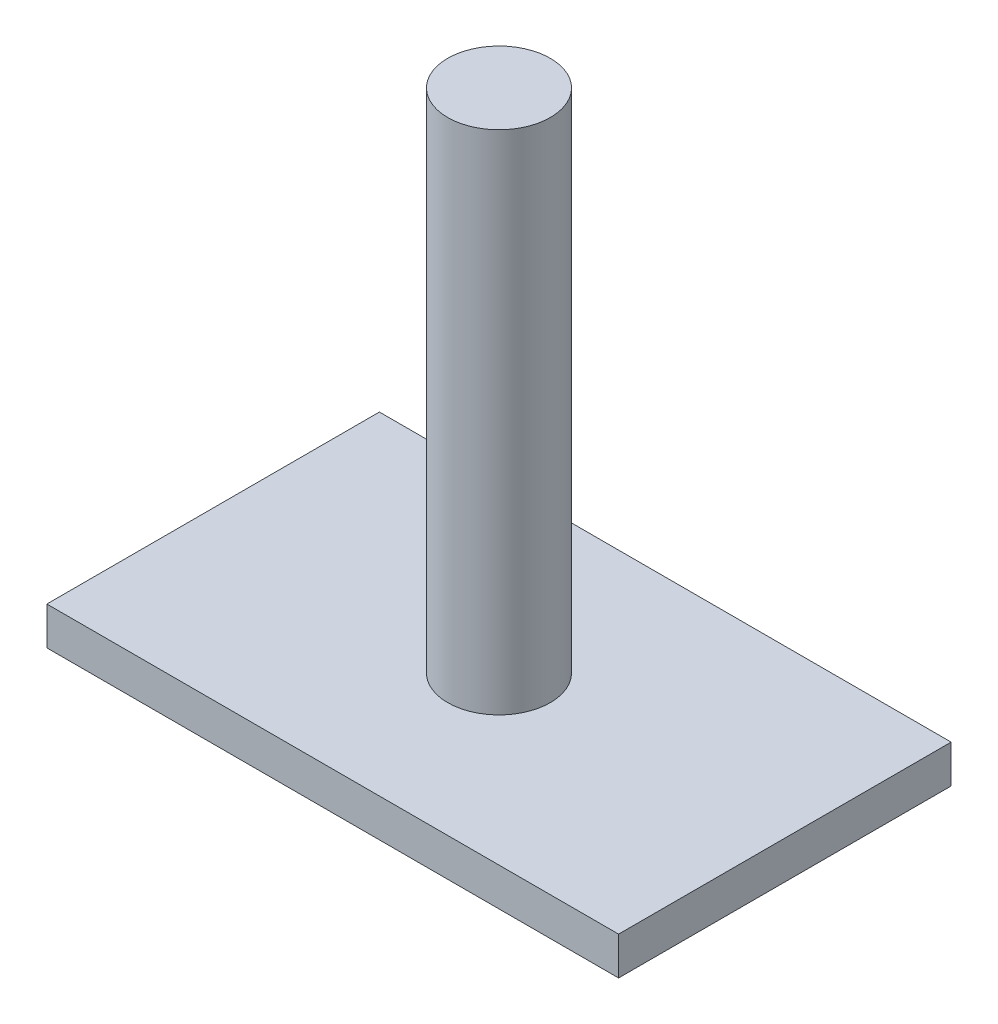
ISO-10303-21;
HEADER;
FILE_DESCRIPTION(('STEP AP214'),'2;1');
FILE_NAME('part.step','',(''),(''),'','','');
FILE_SCHEMA(('AUTOMOTIVE_DESIGN { 1 0 10303 214 1 1 1 1 }'));
ENDSEC;
DATA;
#1=APPLICATION_CONTEXT('core data for automotive mechanical design processes');
#2=APPLICATION_PROTOCOL_DEFINITION('international standard','automotive_design',2000,#1);
#3=PRODUCT_CONTEXT('',#1,'mechanical');
#4=PRODUCT('Part','Part','',(#3));
#5=PRODUCT_RELATED_PRODUCT_CATEGORY('part','',(#4));
#6=PRODUCT_DEFINITION_FORMATION('','',#4);
#7=PRODUCT_DEFINITION_CONTEXT('part definition',#1,'design');
#8=PRODUCT_DEFINITION('design','',#6,#7);
#9=PRODUCT_DEFINITION_SHAPE('','',#8);
#10=(LENGTH_UNIT() NAMED_UNIT(*) SI_UNIT(.MILLI.,.METRE.));
#11=(NAMED_UNIT(*) PLANE_ANGLE_UNIT() SI_UNIT($,.RADIAN.));
#12=(NAMED_UNIT(*) SI_UNIT($,.STERADIAN.) SOLID_ANGLE_UNIT());
#13=UNCERTAINTY_MEASURE_WITH_UNIT(LENGTH_MEASURE(1.E-05),#10,'distance_accuracy_value','');
#14=(GEOMETRIC_REPRESENTATION_CONTEXT(3) GLOBAL_UNCERTAINTY_ASSIGNED_CONTEXT((#13)) GLOBAL_UNIT_ASSIGNED_CONTEXT((#10,
#11,#12)) REPRESENTATION_CONTEXT('',''));
#15=CARTESIAN_POINT('',(0.,0.,0.));
#16=DIRECTION('',(0.,0.,1.));
#17=DIRECTION('',(1.,0.,0.));
#18=AXIS2_PLACEMENT_3D('',#15,#16,#17);
#19=CARTESIAN_POINT('',(0.,40.,0.));
#20=DIRECTION('',(0.,-1.,0.));
#21=DIRECTION('',(0.,0.,-1.));
#22=AXIS2_PLACEMENT_3D('',#19,#20,#21);
#23=CYLINDRICAL_SURFACE('',#22,4.05);
#24=CARTESIAN_POINT('',(0.,40.,0.));
#25=DIRECTION('',(0.,1.,0.));
#26=DIRECTION('',(0.,0.,1.));
#27=AXIS2_PLACEMENT_3D('',#24,#25,#26);
#28=CIRCLE('',#27,4.05);
#29=CARTESIAN_POINT('',(0.,40.,4.05));
#30=VERTEX_POINT('',#29);
#31=EDGE_CURVE('E11',#30,#30,#28,.T.);
#32=ORIENTED_EDGE('',*,*,#31,.F.);
#33=EDGE_LOOP('',(#32));
#34=FACE_BOUND('',#33,.T.);
#35=CARTESIAN_POINT('',(0.,0.,0.));
#36=DIRECTION('',(0.,1.,0.));
#37=DIRECTION('',(0.,0.,1.));
#38=AXIS2_PLACEMENT_3D('',#35,#36,#37);
#39=CIRCLE('',#38,4.05);
#40=CARTESIAN_POINT('',(0.,0.,4.05));
#41=VERTEX_POINT('',#40);
#42=EDGE_CURVE('E36',#41,#41,#39,.T.);
#43=ORIENTED_EDGE('',*,*,#42,.T.);
#44=EDGE_LOOP('',(#43));
#45=FACE_BOUND('',#44,.T.);
#46=ADVANCED_FACE('F33',(#34,#45),#23,.T.);
#47=CARTESIAN_POINT('',(0.,40.,0.));
#48=DIRECTION('',(0.,1.,0.));
#49=DIRECTION('',(0.,0.,1.));
#50=AXIS2_PLACEMENT_3D('',#47,#48,#49);
#51=PLANE('',#50);
#52=ORIENTED_EDGE('',*,*,#31,.T.);
#53=EDGE_LOOP('',(#52));
#54=FACE_BOUND('',#53,.T.);
#55=ADVANCED_FACE('F129',(#54),#51,.T.);
#56=CARTESIAN_POINT('',(22.5639988281978,-3.,13.1244227055141));
#57=DIRECTION('',(-1.,0.,0.));
#58=DIRECTION('',(0.,0.,1.));
#59=AXIS2_PLACEMENT_3D('',#56,#57,#58);
#60=PLANE('',#59);
#61=DIRECTION('',(0.,0.,1.));
#62=VECTOR('',#61,1.);
#63=CARTESIAN_POINT('',(22.5639988281978,0.,13.1244227055141));
#64=LINE('',#63,#62);
#65=CARTESIAN_POINT('',(22.5639988281978,0.,-13.1244227055141));
#66=VERTEX_POINT('',#65);
#67=CARTESIAN_POINT('',(22.5639988281978,0.,13.1244227055141));
#68=VERTEX_POINT('',#67);
#69=EDGE_CURVE('E100',#66,#68,#64,.T.);
#70=ORIENTED_EDGE('',*,*,#69,.T.);
#71=DIRECTION('',(0.,1.,0.));
#72=VECTOR('',#71,1.);
#73=CARTESIAN_POINT('',(22.5639988281978,-3.,13.1244227055141));
#74=LINE('',#73,#72);
#75=CARTESIAN_POINT('',(22.5639988281978,-3.,13.1244227055141));
#76=VERTEX_POINT('',#75);
#77=EDGE_CURVE('E91',#76,#68,#74,.T.);
#78=ORIENTED_EDGE('',*,*,#77,.F.);
#79=DIRECTION('',(0.,0.,1.));
#80=VECTOR('',#79,1.);
#81=CARTESIAN_POINT('',(22.5639988281978,-3.,13.1244227055141));
#82=LINE('',#81,#80);
#83=CARTESIAN_POINT('',(22.5639988281978,-3.,-13.1244227055141));
#84=VERTEX_POINT('',#83);
#85=EDGE_CURVE('E85',#84,#76,#82,.T.);
#86=ORIENTED_EDGE('',*,*,#85,.F.);
#87=DIRECTION('',(0.,1.,0.));
#88=VECTOR('',#87,1.);
#89=CARTESIAN_POINT('',(22.5639988281978,-3.,-13.1244227055141));
#90=LINE('',#89,#88);
#91=EDGE_CURVE('E96',#84,#66,#90,.T.);
#92=ORIENTED_EDGE('',*,*,#91,.T.);
#93=EDGE_LOOP('',(#70,#78,#86,#92));
#94=FACE_BOUND('',#93,.T.);
#95=ADVANCED_FACE('F118',(#94),#60,.F.);
#96=CARTESIAN_POINT('',(-22.5639988281978,-3.,13.1244227055141));
#97=DIRECTION('',(0.,0.,-1.));
#98=DIRECTION('',(-1.,0.,0.));
#99=AXIS2_PLACEMENT_3D('',#96,#97,#98);
#100=PLANE('',#99);
#101=DIRECTION('',(-1.,0.,0.));
#102=VECTOR('',#101,1.);
#103=CARTESIAN_POINT('',(-22.5639988281978,0.,13.1244227055141));
#104=LINE('',#103,#102);
#105=CARTESIAN_POINT('',(-22.5639988281978,0.,13.1244227055141));
#106=VERTEX_POINT('',#105);
#107=EDGE_CURVE('E90',#68,#106,#104,.T.);
#108=ORIENTED_EDGE('',*,*,#107,.T.);
#109=DIRECTION('',(0.,1.,0.));
#110=VECTOR('',#109,1.);
#111=CARTESIAN_POINT('',(-22.5639988281978,-3.,13.1244227055141));
#112=LINE('',#111,#110);
#113=CARTESIAN_POINT('',(-22.5639988281978,-3.,13.1244227055141));
#114=VERTEX_POINT('',#113);
#115=EDGE_CURVE('E88',#114,#106,#112,.T.);
#116=ORIENTED_EDGE('',*,*,#115,.F.);
#117=DIRECTION('',(-1.,0.,0.));
#118=VECTOR('',#117,1.);
#119=CARTESIAN_POINT('',(-22.5639988281978,-3.,13.1244227055141));
#120=LINE('',#119,#118);
#121=EDGE_CURVE('E80',#76,#114,#120,.T.);
#122=ORIENTED_EDGE('',*,*,#121,.F.);
#123=ORIENTED_EDGE('',*,*,#77,.T.);
#124=EDGE_LOOP('',(#108,#116,#122,#123));
#125=FACE_BOUND('',#124,.T.);
#126=ADVANCED_FACE('F89',(#125),#100,.F.);
#127=CARTESIAN_POINT('',(-22.5639988281978,-3.,13.1244227055141));
#128=DIRECTION('',(1.,0.,0.));
#129=DIRECTION('',(0.,0.,-1.));
#130=AXIS2_PLACEMENT_3D('',#127,#128,#129);
#131=PLANE('',#130);
#132=DIRECTION('',(0.,0.,-1.));
#133=VECTOR('',#132,1.);
#134=CARTESIAN_POINT('',(-22.5639988281978,0.,13.1244227055141));
#135=LINE('',#134,#133);
#136=CARTESIAN_POINT('',(-22.5639988281978,0.,-13.1244227055141));
#137=VERTEX_POINT('',#136);
#138=EDGE_CURVE('E66',#106,#137,#135,.T.);
#139=ORIENTED_EDGE('',*,*,#138,.T.);
#140=DIRECTION('',(0.,1.,0.));
#141=VECTOR('',#140,1.);
#142=CARTESIAN_POINT('',(-22.5639988281978,-3.,-13.1244227055141));
#143=LINE('',#142,#141);
#144=CARTESIAN_POINT('',(-22.5639988281978,-3.,-13.1244227055141));
#145=VERTEX_POINT('',#144);
#146=EDGE_CURVE('E92',#145,#137,#143,.T.);
#147=ORIENTED_EDGE('',*,*,#146,.F.);
#148=DIRECTION('',(0.,0.,-1.));
#149=VECTOR('',#148,1.);
#150=CARTESIAN_POINT('',(-22.5639988281978,-3.,13.1244227055141));
#151=LINE('',#150,#149);
#152=EDGE_CURVE('E83',#114,#145,#151,.T.);
#153=ORIENTED_EDGE('',*,*,#152,.F.);
#154=ORIENTED_EDGE('',*,*,#115,.T.);
#155=EDGE_LOOP('',(#139,#147,#153,#154));
#156=FACE_BOUND('',#155,.T.);
#157=ADVANCED_FACE('F94',(#156),#131,.F.);
#158=CARTESIAN_POINT('',(-22.5639988281978,-3.,-13.1244227055141));
#159=DIRECTION('',(0.,0.,1.));
#160=DIRECTION('',(1.,0.,0.));
#161=AXIS2_PLACEMENT_3D('',#158,#159,#160);
#162=PLANE('',#161);
#163=DIRECTION('',(1.,0.,0.));
#164=VECTOR('',#163,1.);
#165=CARTESIAN_POINT('',(-22.5639988281978,0.,-13.1244227055141));
#166=LINE('',#165,#164);
#167=EDGE_CURVE('E72',#137,#66,#166,.T.);
#168=ORIENTED_EDGE('',*,*,#167,.T.);
#169=ORIENTED_EDGE('',*,*,#91,.F.);
#170=DIRECTION('',(1.,0.,0.));
#171=VECTOR('',#170,1.);
#172=CARTESIAN_POINT('',(-22.5639988281978,-3.,-13.1244227055141));
#173=LINE('',#172,#171);
#174=EDGE_CURVE('E49',#145,#84,#173,.T.);
#175=ORIENTED_EDGE('',*,*,#174,.F.);
#176=ORIENTED_EDGE('',*,*,#146,.T.);
#177=EDGE_LOOP('',(#168,#169,#175,#176));
#178=FACE_BOUND('',#177,.T.);
#179=ADVANCED_FACE('F119',(#178),#162,.F.);
#180=CARTESIAN_POINT('',(0.,-3.,0.));
#181=DIRECTION('',(0.,-1.,0.));
#182=DIRECTION('',(0.,0.,-1.));
#183=AXIS2_PLACEMENT_3D('',#180,#181,#182);
#184=PLANE('',#183);
#185=ORIENTED_EDGE('',*,*,#85,.T.);
#186=ORIENTED_EDGE('',*,*,#121,.T.);
#187=ORIENTED_EDGE('',*,*,#152,.T.);
#188=ORIENTED_EDGE('',*,*,#174,.T.);
#189=EDGE_LOOP('',(#185,#186,#187,#188));
#190=FACE_BOUND('',#189,.T.);
#191=ADVANCED_FACE('F81',(#190),#184,.T.);
#192=CARTESIAN_POINT('',(0.,0.,0.));
#193=DIRECTION('',(0.,-1.,0.));
#194=DIRECTION('',(0.,0.,-1.));
#195=AXIS2_PLACEMENT_3D('',#192,#193,#194);
#196=PLANE('',#195);
#197=ORIENTED_EDGE('',*,*,#42,.F.);
#198=EDGE_LOOP('',(#197));
#199=FACE_BOUND('',#198,.T.);
#200=ORIENTED_EDGE('',*,*,#69,.F.);
#201=ORIENTED_EDGE('',*,*,#167,.F.);
#202=ORIENTED_EDGE('',*,*,#138,.F.);
#203=ORIENTED_EDGE('',*,*,#107,.F.);
#204=EDGE_LOOP('',(#200,#201,#202,#203));
#205=FACE_BOUND('',#204,.T.);
#206=ADVANCED_FACE('F112',(#199,#205),#196,.F.);
#207=CLOSED_SHELL('',(#46,#55,#95,#126,#157,#179,#191,#206));
#208=MANIFOLD_SOLID_BREP('B2',#207);
#209=ADVANCED_BREP_SHAPE_REPRESENTATION('',(#18,#208),#14);
#210=SHAPE_DEFINITION_REPRESENTATION(#9,#209);
ENDSEC;
END-ISO-10303-21;
